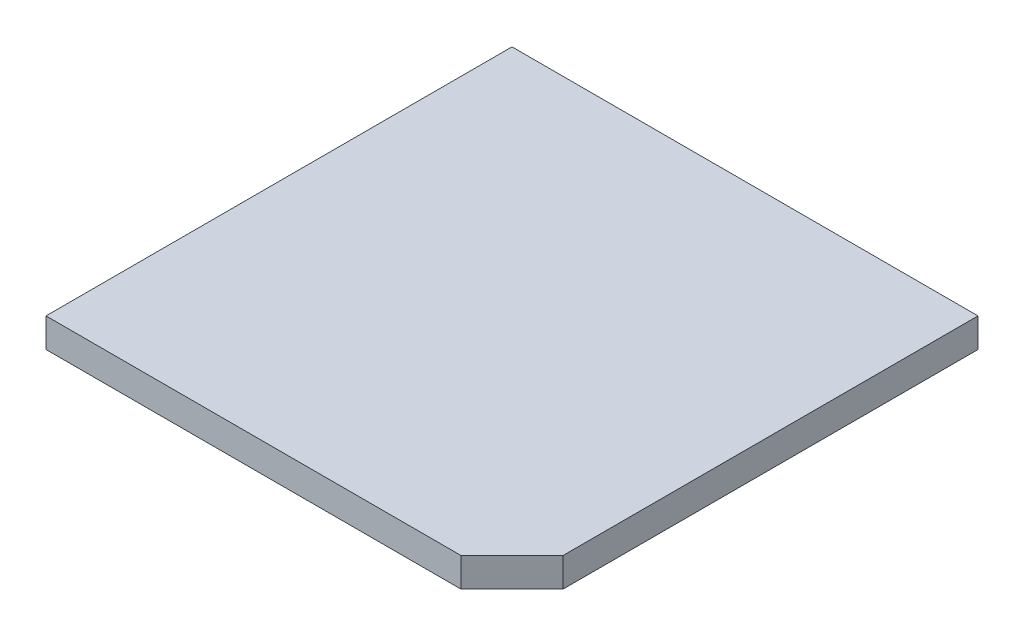
ISO-10303-21;
HEADER;
FILE_DESCRIPTION(('STEP AP214'),'2;1');
FILE_NAME('part.step','',(''),(''),'','','');
FILE_SCHEMA(('AUTOMOTIVE_DESIGN { 1 0 10303 214 1 1 1 1 }'));
ENDSEC;
DATA;
#1=APPLICATION_CONTEXT('core data for automotive mechanical design processes');
#2=APPLICATION_PROTOCOL_DEFINITION('international standard','automotive_design',2000,#1);
#3=PRODUCT_CONTEXT('',#1,'mechanical');
#4=PRODUCT('Part','Part','',(#3));
#5=PRODUCT_RELATED_PRODUCT_CATEGORY('part','',(#4));
#6=PRODUCT_DEFINITION_FORMATION('','',#4);
#7=PRODUCT_DEFINITION_CONTEXT('part definition',#1,'design');
#8=PRODUCT_DEFINITION('design','',#6,#7);
#9=PRODUCT_DEFINITION_SHAPE('','',#8);
#10=(LENGTH_UNIT() NAMED_UNIT(*) SI_UNIT(.MILLI.,.METRE.));
#11=(NAMED_UNIT(*) PLANE_ANGLE_UNIT() SI_UNIT($,.RADIAN.));
#12=(NAMED_UNIT(*) SI_UNIT($,.STERADIAN.) SOLID_ANGLE_UNIT());
#13=UNCERTAINTY_MEASURE_WITH_UNIT(LENGTH_MEASURE(1.E-05),#10,'distance_accuracy_value','');
#14=(GEOMETRIC_REPRESENTATION_CONTEXT(3) GLOBAL_UNCERTAINTY_ASSIGNED_CONTEXT((#13)) GLOBAL_UNIT_ASSIGNED_CONTEXT((#10,
#11,#12)) REPRESENTATION_CONTEXT('',''));
#15=CARTESIAN_POINT('',(0.,0.,0.));
#16=DIRECTION('',(0.,0.,1.));
#17=DIRECTION('',(1.,0.,0.));
#18=AXIS2_PLACEMENT_3D('',#15,#16,#17);
#19=CARTESIAN_POINT('',(1.6,0.2,-1.6));
#20=DIRECTION('',(-1.,0.,0.));
#21=DIRECTION('',(0.,0.,1.));
#22=AXIS2_PLACEMENT_3D('',#19,#20,#21);
#23=PLANE('',#22);
#24=DIRECTION('',(0.,0.,-1.));
#25=VECTOR('',#24,1.);
#26=CARTESIAN_POINT('',(1.6,0.2,-1.6));
#27=LINE('',#26,#25);
#28=CARTESIAN_POINT('',(1.6,0.2,1.25));
#29=VERTEX_POINT('',#28);
#30=CARTESIAN_POINT('',(1.6,0.2,-1.6));
#31=VERTEX_POINT('',#30);
#32=EDGE_CURVE('E86',#29,#31,#27,.T.);
#33=ORIENTED_EDGE('',*,*,#32,.F.);
#34=DIRECTION('',(0.,-1.,0.));
#35=VECTOR('',#34,1.);
#36=CARTESIAN_POINT('',(1.6,0.2,1.25));
#37=LINE('',#36,#35);
#38=CARTESIAN_POINT('',(1.6,0.,1.25));
#39=VERTEX_POINT('',#38);
#40=EDGE_CURVE('E112',#29,#39,#37,.T.);
#41=ORIENTED_EDGE('',*,*,#40,.T.);
#42=DIRECTION('',(0.,0.,-1.));
#43=VECTOR('',#42,1.);
#44=CARTESIAN_POINT('',(1.6,0.,-1.6));
#45=LINE('',#44,#43);
#46=CARTESIAN_POINT('',(1.6,0.,-1.6));
#47=VERTEX_POINT('',#46);
#48=EDGE_CURVE('E109',#39,#47,#45,.T.);
#49=ORIENTED_EDGE('',*,*,#48,.T.);
#50=DIRECTION('',(0.,-1.,0.));
#51=VECTOR('',#50,1.);
#52=CARTESIAN_POINT('',(1.6,0.2,-1.6));
#53=LINE('',#52,#51);
#54=EDGE_CURVE('E102',#31,#47,#53,.T.);
#55=ORIENTED_EDGE('',*,*,#54,.F.);
#56=EDGE_LOOP('',(#33,#41,#49,#55));
#57=FACE_BOUND('',#56,.T.);
#58=ADVANCED_FACE('F39',(#57),#23,.F.);
#59=CARTESIAN_POINT('',(-1.6,0.2,-1.6));
#60=DIRECTION('',(0.,0.,1.));
#61=DIRECTION('',(1.,0.,0.));
#62=AXIS2_PLACEMENT_3D('',#59,#60,#61);
#63=PLANE('',#62);
#64=DIRECTION('',(-1.,0.,0.));
#65=VECTOR('',#64,1.);
#66=CARTESIAN_POINT('',(-1.6,0.,-1.6));
#67=LINE('',#66,#65);
#68=CARTESIAN_POINT('',(-1.6,0.,-1.6));
#69=VERTEX_POINT('',#68);
#70=EDGE_CURVE('E132',#47,#69,#67,.T.);
#71=ORIENTED_EDGE('',*,*,#70,.T.);
#72=DIRECTION('',(0.,-1.,0.));
#73=VECTOR('',#72,1.);
#74=CARTESIAN_POINT('',(-1.6,0.2,-1.6));
#75=LINE('',#74,#73);
#76=CARTESIAN_POINT('',(-1.6,0.2,-1.6));
#77=VERTEX_POINT('',#76);
#78=EDGE_CURVE('E104',#77,#69,#75,.T.);
#79=ORIENTED_EDGE('',*,*,#78,.F.);
#80=DIRECTION('',(-1.,0.,0.));
#81=VECTOR('',#80,1.);
#82=CARTESIAN_POINT('',(-1.6,0.2,-1.6));
#83=LINE('',#82,#81);
#84=EDGE_CURVE('E89',#31,#77,#83,.T.);
#85=ORIENTED_EDGE('',*,*,#84,.F.);
#86=ORIENTED_EDGE('',*,*,#54,.T.);
#87=EDGE_LOOP('',(#71,#79,#85,#86));
#88=FACE_BOUND('',#87,.T.);
#89=ADVANCED_FACE('F101',(#88),#63,.F.);
#90=CARTESIAN_POINT('',(-1.6,0.2,-1.6));
#91=DIRECTION('',(1.,0.,0.));
#92=DIRECTION('',(0.,0.,-1.));
#93=AXIS2_PLACEMENT_3D('',#90,#91,#92);
#94=PLANE('',#93);
#95=DIRECTION('',(0.,0.,1.));
#96=VECTOR('',#95,1.);
#97=CARTESIAN_POINT('',(-1.6,0.,-1.6));
#98=LINE('',#97,#96);
#99=CARTESIAN_POINT('',(-1.6,0.,1.6));
#100=VERTEX_POINT('',#99);
#101=EDGE_CURVE('E129',#69,#100,#98,.T.);
#102=ORIENTED_EDGE('',*,*,#101,.T.);
#103=DIRECTION('',(0.,-1.,0.));
#104=VECTOR('',#103,1.);
#105=CARTESIAN_POINT('',(-1.6,0.2,1.6));
#106=LINE('',#105,#104);
#107=CARTESIAN_POINT('',(-1.6,0.2,1.6));
#108=VERTEX_POINT('',#107);
#109=EDGE_CURVE('E117',#108,#100,#106,.T.);
#110=ORIENTED_EDGE('',*,*,#109,.F.);
#111=DIRECTION('',(0.,0.,1.));
#112=VECTOR('',#111,1.);
#113=CARTESIAN_POINT('',(-1.6,0.2,-1.6));
#114=LINE('',#113,#112);
#115=EDGE_CURVE('E107',#77,#108,#114,.T.);
#116=ORIENTED_EDGE('',*,*,#115,.F.);
#117=ORIENTED_EDGE('',*,*,#78,.T.);
#118=EDGE_LOOP('',(#102,#110,#116,#117));
#119=FACE_BOUND('',#118,.T.);
#120=ADVANCED_FACE('F142',(#119),#94,.F.);
#121=CARTESIAN_POINT('',(-1.6,0.2,1.6));
#122=DIRECTION('',(0.,0.,-1.));
#123=DIRECTION('',(-1.,0.,0.));
#124=AXIS2_PLACEMENT_3D('',#121,#122,#123);
#125=PLANE('',#124);
#126=DIRECTION('',(1.,0.,0.));
#127=VECTOR('',#126,1.);
#128=CARTESIAN_POINT('',(-1.6,0.,1.6));
#129=LINE('',#128,#127);
#130=CARTESIAN_POINT('',(1.25,0.,1.6));
#131=VERTEX_POINT('',#130);
#132=EDGE_CURVE('E97',#100,#131,#129,.T.);
#133=ORIENTED_EDGE('',*,*,#132,.T.);
#134=DIRECTION('',(0.,1.,0.));
#135=VECTOR('',#134,1.);
#136=CARTESIAN_POINT('',(1.25,0.2,1.6));
#137=LINE('',#136,#135);
#138=CARTESIAN_POINT('',(1.25,0.2,1.6));
#139=VERTEX_POINT('',#138);
#140=EDGE_CURVE('E48',#131,#139,#137,.T.);
#141=ORIENTED_EDGE('',*,*,#140,.T.);
#142=DIRECTION('',(1.,0.,0.));
#143=VECTOR('',#142,1.);
#144=CARTESIAN_POINT('',(-1.6,0.2,1.6));
#145=LINE('',#144,#143);
#146=EDGE_CURVE('E126',#108,#139,#145,.T.);
#147=ORIENTED_EDGE('',*,*,#146,.F.);
#148=ORIENTED_EDGE('',*,*,#109,.T.);
#149=EDGE_LOOP('',(#133,#141,#147,#148));
#150=FACE_BOUND('',#149,.T.);
#151=ADVANCED_FACE('F144',(#150),#125,.F.);
#152=CARTESIAN_POINT('',(0.,0.2,0.));
#153=DIRECTION('',(0.,1.,0.));
#154=DIRECTION('',(0.,0.,1.));
#155=AXIS2_PLACEMENT_3D('',#152,#153,#154);
#156=PLANE('',#155);
#157=ORIENTED_EDGE('',*,*,#146,.T.);
#158=DIRECTION('',(-0.707106781186549,0.,0.707106781186546));
#159=VECTOR('',#158,1.);
#160=CARTESIAN_POINT('',(1.425,0.2,1.425));
#161=LINE('',#160,#159);
#162=EDGE_CURVE('E11',#139,#29,#161,.F.);
#163=ORIENTED_EDGE('',*,*,#162,.T.);
#164=ORIENTED_EDGE('',*,*,#32,.T.);
#165=ORIENTED_EDGE('',*,*,#84,.T.);
#166=ORIENTED_EDGE('',*,*,#115,.T.);
#167=EDGE_LOOP('',(#157,#163,#164,#165,#166));
#168=FACE_BOUND('',#167,.T.);
#169=ADVANCED_FACE('F88',(#168),#156,.T.);
#170=CARTESIAN_POINT('',(0.,0.,0.));
#171=DIRECTION('',(0.,1.,0.));
#172=DIRECTION('',(0.,0.,1.));
#173=AXIS2_PLACEMENT_3D('',#170,#171,#172);
#174=PLANE('',#173);
#175=ORIENTED_EDGE('',*,*,#48,.F.);
#176=DIRECTION('',(0.707106781186549,0.,-0.707106781186546));
#177=VECTOR('',#176,1.);
#178=CARTESIAN_POINT('',(1.6,0.,1.25));
#179=LINE('',#178,#177);
#180=EDGE_CURVE('E62',#39,#131,#179,.F.);
#181=ORIENTED_EDGE('',*,*,#180,.T.);
#182=ORIENTED_EDGE('',*,*,#132,.F.);
#183=ORIENTED_EDGE('',*,*,#101,.F.);
#184=ORIENTED_EDGE('',*,*,#70,.F.);
#185=EDGE_LOOP('',(#175,#181,#182,#183,#184));
#186=FACE_BOUND('',#185,.T.);
#187=ADVANCED_FACE('F151',(#186),#174,.F.);
#188=CARTESIAN_POINT('',(1.6,0.2,1.25));
#189=DIRECTION('',(-0.707106781186546,0.,-0.707106781186549));
#190=DIRECTION('',(0.,-1.,0.));
#191=AXIS2_PLACEMENT_3D('',#188,#189,#190);
#192=PLANE('',#191);
#193=ORIENTED_EDGE('',*,*,#162,.F.);
#194=ORIENTED_EDGE('',*,*,#140,.F.);
#195=ORIENTED_EDGE('',*,*,#180,.F.);
#196=ORIENTED_EDGE('',*,*,#40,.F.);
#197=EDGE_LOOP('',(#193,#194,#195,#196));
#198=FACE_BOUND('',#197,.T.);
#199=ADVANCED_FACE('F41',(#198),#192,.F.);
#200=CLOSED_SHELL('',(#58,#89,#120,#151,#169,#187,#199));
#201=MANIFOLD_SOLID_BREP('B2',#200);
#202=ADVANCED_BREP_SHAPE_REPRESENTATION('',(#18,#201),#14);
#203=SHAPE_DEFINITION_REPRESENTATION(#9,#202);
ENDSEC;
END-ISO-10303-21;
